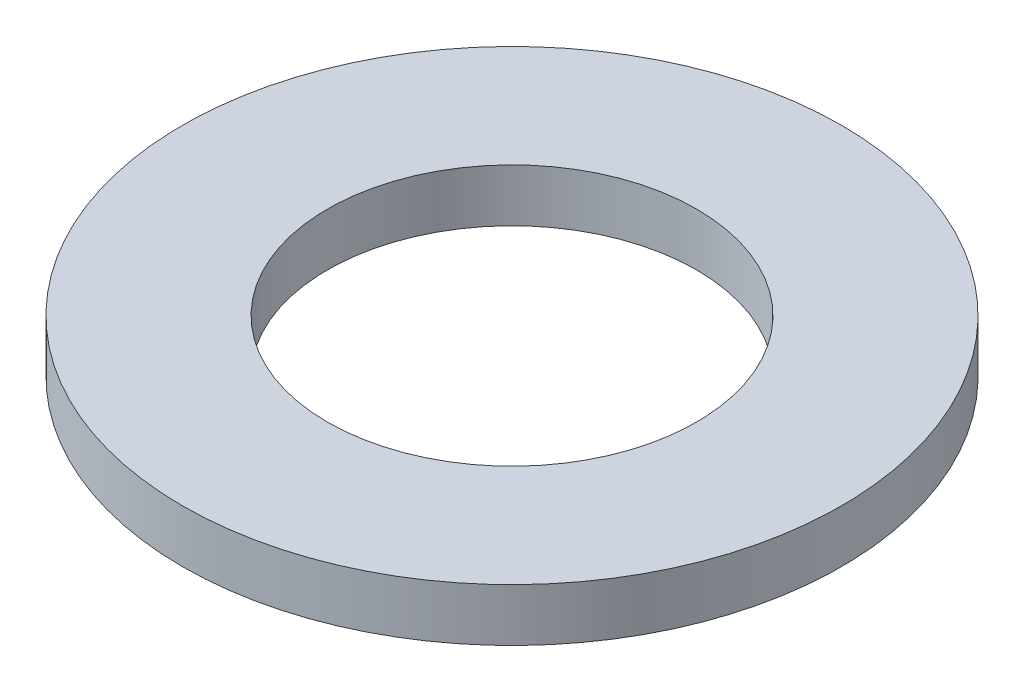
ISO-10303-21;
HEADER;
FILE_DESCRIPTION(('STEP AP214'),'2;1');
FILE_NAME('part.step','',(''),(''),'','','');
FILE_SCHEMA(('AUTOMOTIVE_DESIGN { 1 0 10303 214 1 1 1 1 }'));
ENDSEC;
DATA;
#1=APPLICATION_CONTEXT('core data for automotive mechanical design processes');
#2=APPLICATION_PROTOCOL_DEFINITION('international standard','automotive_design',2000,#1);
#3=PRODUCT_CONTEXT('',#1,'mechanical');
#4=PRODUCT('Part','Part','',(#3));
#5=PRODUCT_RELATED_PRODUCT_CATEGORY('part','',(#4));
#6=PRODUCT_DEFINITION_FORMATION('','',#4);
#7=PRODUCT_DEFINITION_CONTEXT('part definition',#1,'design');
#8=PRODUCT_DEFINITION('design','',#6,#7);
#9=PRODUCT_DEFINITION_SHAPE('','',#8);
#10=(LENGTH_UNIT() NAMED_UNIT(*) SI_UNIT(.MILLI.,.METRE.));
#11=(NAMED_UNIT(*) PLANE_ANGLE_UNIT() SI_UNIT($,.RADIAN.));
#12=(NAMED_UNIT(*) SI_UNIT($,.STERADIAN.) SOLID_ANGLE_UNIT());
#13=UNCERTAINTY_MEASURE_WITH_UNIT(LENGTH_MEASURE(1.E-05),#10,'distance_accuracy_value','');
#14=(GEOMETRIC_REPRESENTATION_CONTEXT(3) GLOBAL_UNCERTAINTY_ASSIGNED_CONTEXT((#13)) GLOBAL_UNIT_ASSIGNED_CONTEXT((#10,
#11,#12)) REPRESENTATION_CONTEXT('',''));
#15=CARTESIAN_POINT('',(0.,0.,0.));
#16=DIRECTION('',(0.,0.,1.));
#17=DIRECTION('',(1.,0.,0.));
#18=AXIS2_PLACEMENT_3D('',#15,#16,#17);
#19=CARTESIAN_POINT('',(0.,2.,0.));
#20=DIRECTION('',(0.,1.,0.));
#21=DIRECTION('',(0.,0.,1.));
#22=AXIS2_PLACEMENT_3D('',#19,#20,#21);
#23=PLANE('',#22);
#24=CARTESIAN_POINT('',(0.,2.,0.));
#25=DIRECTION('',(0.,1.,0.));
#26=DIRECTION('',(0.,0.,1.));
#27=AXIS2_PLACEMENT_3D('',#24,#25,#26);
#28=CIRCLE('',#27,12.5);
#29=CARTESIAN_POINT('',(0.,2.,12.5));
#30=VERTEX_POINT('',#29);
#31=EDGE_CURVE('E10',#30,#30,#28,.T.);
#32=ORIENTED_EDGE('',*,*,#31,.T.);
#33=EDGE_LOOP('',(#32));
#34=FACE_BOUND('',#33,.T.);
#35=CARTESIAN_POINT('',(0.,2.,0.));
#36=DIRECTION('',(0.,1.,0.));
#37=DIRECTION('',(0.,0.,1.));
#38=AXIS2_PLACEMENT_3D('',#35,#36,#37);
#39=CIRCLE('',#38,7.);
#40=CARTESIAN_POINT('',(0.,2.,7.));
#41=VERTEX_POINT('',#40);
#42=EDGE_CURVE('E40',#41,#41,#39,.T.);
#43=ORIENTED_EDGE('',*,*,#42,.F.);
#44=EDGE_LOOP('',(#43));
#45=FACE_BOUND('',#44,.T.);
#46=ADVANCED_FACE('F29',(#34,#45),#23,.T.);
#47=CARTESIAN_POINT('',(0.,0.,0.));
#48=DIRECTION('',(0.,1.,0.));
#49=DIRECTION('',(0.,0.,1.));
#50=AXIS2_PLACEMENT_3D('',#47,#48,#49);
#51=PLANE('',#50);
#52=CARTESIAN_POINT('',(0.,0.,0.));
#53=DIRECTION('',(0.,1.,0.));
#54=DIRECTION('',(0.,0.,1.));
#55=AXIS2_PLACEMENT_3D('',#52,#53,#54);
#56=CIRCLE('',#55,12.5);
#57=CARTESIAN_POINT('',(0.,0.,12.5));
#58=VERTEX_POINT('',#57);
#59=EDGE_CURVE('E33',#58,#58,#56,.T.);
#60=ORIENTED_EDGE('',*,*,#59,.F.);
#61=EDGE_LOOP('',(#60));
#62=FACE_BOUND('',#61,.T.);
#63=CARTESIAN_POINT('',(0.,0.,0.));
#64=DIRECTION('',(0.,1.,0.));
#65=DIRECTION('',(0.,0.,1.));
#66=AXIS2_PLACEMENT_3D('',#63,#64,#65);
#67=CIRCLE('',#66,7.);
#68=CARTESIAN_POINT('',(0.,0.,7.));
#69=VERTEX_POINT('',#68);
#70=EDGE_CURVE('E42',#69,#69,#67,.T.);
#71=ORIENTED_EDGE('',*,*,#70,.T.);
#72=EDGE_LOOP('',(#71));
#73=FACE_BOUND('',#72,.T.);
#74=ADVANCED_FACE('F52',(#62,#73),#51,.F.);
#75=CARTESIAN_POINT('',(0.,2.,0.));
#76=DIRECTION('',(0.,-1.,0.));
#77=DIRECTION('',(0.,0.,-1.));
#78=AXIS2_PLACEMENT_3D('',#75,#76,#77);
#79=CYLINDRICAL_SURFACE('',#78,12.5);
#80=ORIENTED_EDGE('',*,*,#31,.F.);
#81=EDGE_LOOP('',(#80));
#82=FACE_BOUND('',#81,.T.);
#83=ORIENTED_EDGE('',*,*,#59,.T.);
#84=EDGE_LOOP('',(#83));
#85=FACE_BOUND('',#84,.T.);
#86=ADVANCED_FACE('F31',(#82,#85),#79,.T.);
#87=CARTESIAN_POINT('',(0.,2.,0.));
#88=DIRECTION('',(0.,-1.,0.));
#89=DIRECTION('',(0.,0.,-1.));
#90=AXIS2_PLACEMENT_3D('',#87,#88,#89);
#91=CYLINDRICAL_SURFACE('',#90,7.);
#92=ORIENTED_EDGE('',*,*,#42,.T.);
#93=EDGE_LOOP('',(#92));
#94=FACE_BOUND('',#93,.T.);
#95=ORIENTED_EDGE('',*,*,#70,.F.);
#96=EDGE_LOOP('',(#95));
#97=FACE_BOUND('',#96,.T.);
#98=ADVANCED_FACE('F48',(#94,#97),#91,.F.);
#99=CLOSED_SHELL('',(#46,#74,#86,#98));
#100=MANIFOLD_SOLID_BREP('B2',#99);
#101=ADVANCED_BREP_SHAPE_REPRESENTATION('',(#18,#100),#14);
#102=SHAPE_DEFINITION_REPRESENTATION(#9,#101);
ENDSEC;
END-ISO-10303-21;
